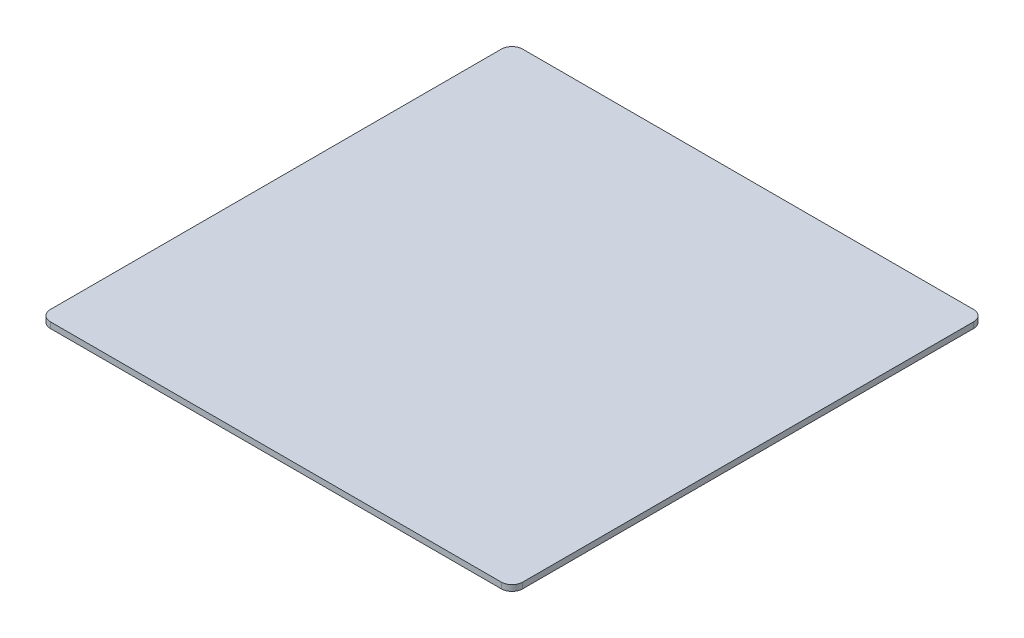
ISO-10303-21;
HEADER;
FILE_DESCRIPTION(('STEP AP214'),'2;1');
FILE_NAME('part.step','',(''),(''),'','','');
FILE_SCHEMA(('AUTOMOTIVE_DESIGN { 1 0 10303 214 1 1 1 1 }'));
ENDSEC;
DATA;
#1=APPLICATION_CONTEXT('core data for automotive mechanical design processes');
#2=APPLICATION_PROTOCOL_DEFINITION('international standard','automotive_design',2000,#1);
#3=PRODUCT_CONTEXT('',#1,'mechanical');
#4=PRODUCT('Part','Part','',(#3));
#5=PRODUCT_RELATED_PRODUCT_CATEGORY('part','',(#4));
#6=PRODUCT_DEFINITION_FORMATION('','',#4);
#7=PRODUCT_DEFINITION_CONTEXT('part definition',#1,'design');
#8=PRODUCT_DEFINITION('design','',#6,#7);
#9=PRODUCT_DEFINITION_SHAPE('','',#8);
#10=(LENGTH_UNIT() NAMED_UNIT(*) SI_UNIT(.MILLI.,.METRE.));
#11=(NAMED_UNIT(*) PLANE_ANGLE_UNIT() SI_UNIT($,.RADIAN.));
#12=(NAMED_UNIT(*) SI_UNIT($,.STERADIAN.) SOLID_ANGLE_UNIT());
#13=UNCERTAINTY_MEASURE_WITH_UNIT(LENGTH_MEASURE(1.E-05),#10,'distance_accuracy_value','');
#14=(GEOMETRIC_REPRESENTATION_CONTEXT(3) GLOBAL_UNCERTAINTY_ASSIGNED_CONTEXT((#13)) GLOBAL_UNIT_ASSIGNED_CONTEXT((#10,
#11,#12)) REPRESENTATION_CONTEXT('',''));
#15=CARTESIAN_POINT('',(0.,0.,0.));
#16=DIRECTION('',(0.,0.,1.));
#17=DIRECTION('',(1.,0.,0.));
#18=AXIS2_PLACEMENT_3D('',#15,#16,#17);
#19=CARTESIAN_POINT('',(148.,3.85,148.));
#20=DIRECTION('',(0.,-1.,0.));
#21=DIRECTION('',(0.,0.,-1.));
#22=AXIS2_PLACEMENT_3D('',#19,#20,#21);
#23=CYLINDRICAL_SURFACE('',#22,7.);
#24=CARTESIAN_POINT('',(148.,3.85,148.));
#25=DIRECTION('',(0.,1.,0.));
#26=DIRECTION('',(0.,0.,-1.));
#27=AXIS2_PLACEMENT_3D('',#24,#25,#26);
#28=CIRCLE('',#27,7.);
#29=CARTESIAN_POINT('',(148.,3.85,155.));
#30=VERTEX_POINT('',#29);
#31=CARTESIAN_POINT('',(155.,3.85,148.));
#32=VERTEX_POINT('',#31);
#33=EDGE_CURVE('E96',#30,#32,#28,.T.);
#34=ORIENTED_EDGE('',*,*,#33,.F.);
#35=DIRECTION('',(0.,1.,0.));
#36=VECTOR('',#35,1.);
#37=CARTESIAN_POINT('',(148.,3.85,155.));
#38=LINE('',#37,#36);
#39=CARTESIAN_POINT('',(148.,0.,155.));
#40=VERTEX_POINT('',#39);
#41=EDGE_CURVE('E131',#40,#30,#38,.T.);
#42=ORIENTED_EDGE('',*,*,#41,.F.);
#43=CARTESIAN_POINT('',(148.,0.,148.));
#44=DIRECTION('',(0.,-1.,0.));
#45=DIRECTION('',(0.,0.,-1.));
#46=AXIS2_PLACEMENT_3D('',#43,#44,#45);
#47=CIRCLE('',#46,7.);
#48=CARTESIAN_POINT('',(155.,0.,148.));
#49=VERTEX_POINT('',#48);
#50=EDGE_CURVE('E26',#49,#40,#47,.T.);
#51=ORIENTED_EDGE('',*,*,#50,.F.);
#52=DIRECTION('',(0.,-1.,0.));
#53=VECTOR('',#52,1.);
#54=CARTESIAN_POINT('',(155.,3.85,148.));
#55=LINE('',#54,#53);
#56=EDGE_CURVE('E111',#32,#49,#55,.T.);
#57=ORIENTED_EDGE('',*,*,#56,.F.);
#58=EDGE_LOOP('',(#34,#42,#51,#57));
#59=FACE_BOUND('',#58,.T.);
#60=ADVANCED_FACE('F17',(#59),#23,.T.);
#61=CARTESIAN_POINT('',(148.,3.85,-148.));
#62=DIRECTION('',(0.,-1.,0.));
#63=DIRECTION('',(0.,0.,-1.));
#64=AXIS2_PLACEMENT_3D('',#61,#62,#63);
#65=CYLINDRICAL_SURFACE('',#64,7.);
#66=CARTESIAN_POINT('',(148.,3.85,-148.));
#67=DIRECTION('',(0.,1.,0.));
#68=DIRECTION('',(0.,0.,-1.));
#69=AXIS2_PLACEMENT_3D('',#66,#67,#68);
#70=CIRCLE('',#69,7.);
#71=CARTESIAN_POINT('',(155.,3.85,-148.));
#72=VERTEX_POINT('',#71);
#73=CARTESIAN_POINT('',(148.,3.85,-155.));
#74=VERTEX_POINT('',#73);
#75=EDGE_CURVE('E39',#72,#74,#70,.T.);
#76=ORIENTED_EDGE('',*,*,#75,.F.);
#77=DIRECTION('',(0.,1.,0.));
#78=VECTOR('',#77,1.);
#79=CARTESIAN_POINT('',(155.,3.85,-148.));
#80=LINE('',#79,#78);
#81=CARTESIAN_POINT('',(155.,0.,-148.));
#82=VERTEX_POINT('',#81);
#83=EDGE_CURVE('E120',#82,#72,#80,.T.);
#84=ORIENTED_EDGE('',*,*,#83,.F.);
#85=CARTESIAN_POINT('',(148.,0.,-148.));
#86=DIRECTION('',(0.,-1.,0.));
#87=DIRECTION('',(0.,0.,-1.));
#88=AXIS2_PLACEMENT_3D('',#85,#86,#87);
#89=CIRCLE('',#88,7.);
#90=CARTESIAN_POINT('',(148.,0.,-155.));
#91=VERTEX_POINT('',#90);
#92=EDGE_CURVE('E140',#91,#82,#89,.T.);
#93=ORIENTED_EDGE('',*,*,#92,.F.);
#94=DIRECTION('',(0.,-1.,0.));
#95=VECTOR('',#94,1.);
#96=CARTESIAN_POINT('',(148.,3.85,-155.));
#97=LINE('',#96,#95);
#98=EDGE_CURVE('E139',#74,#91,#97,.T.);
#99=ORIENTED_EDGE('',*,*,#98,.F.);
#100=EDGE_LOOP('',(#76,#84,#93,#99));
#101=FACE_BOUND('',#100,.T.);
#102=ADVANCED_FACE('F219',(#101),#65,.T.);
#103=CARTESIAN_POINT('',(-148.,3.85,148.));
#104=DIRECTION('',(0.,-1.,0.));
#105=DIRECTION('',(0.,0.,-1.));
#106=AXIS2_PLACEMENT_3D('',#103,#104,#105);
#107=CYLINDRICAL_SURFACE('',#106,7.);
#108=CARTESIAN_POINT('',(-148.,3.85,148.));
#109=DIRECTION('',(0.,1.,0.));
#110=DIRECTION('',(0.,0.,-1.));
#111=AXIS2_PLACEMENT_3D('',#108,#109,#110);
#112=CIRCLE('',#111,7.);
#113=CARTESIAN_POINT('',(-155.,3.85,148.));
#114=VERTEX_POINT('',#113);
#115=CARTESIAN_POINT('',(-148.,3.85,155.));
#116=VERTEX_POINT('',#115);
#117=EDGE_CURVE('E108',#114,#116,#112,.T.);
#118=ORIENTED_EDGE('',*,*,#117,.F.);
#119=DIRECTION('',(0.,1.,0.));
#120=VECTOR('',#119,1.);
#121=CARTESIAN_POINT('',(-155.,3.85,148.));
#122=LINE('',#121,#120);
#123=CARTESIAN_POINT('',(-155.,0.,148.));
#124=VERTEX_POINT('',#123);
#125=EDGE_CURVE('E173',#124,#114,#122,.T.);
#126=ORIENTED_EDGE('',*,*,#125,.F.);
#127=CARTESIAN_POINT('',(-148.,0.,148.));
#128=DIRECTION('',(0.,-1.,0.));
#129=DIRECTION('',(0.,0.,-1.));
#130=AXIS2_PLACEMENT_3D('',#127,#128,#129);
#131=CIRCLE('',#130,7.);
#132=CARTESIAN_POINT('',(-148.,0.,155.));
#133=VERTEX_POINT('',#132);
#134=EDGE_CURVE('E11',#133,#124,#131,.T.);
#135=ORIENTED_EDGE('',*,*,#134,.F.);
#136=DIRECTION('',(0.,-1.,0.));
#137=VECTOR('',#136,1.);
#138=CARTESIAN_POINT('',(-148.,3.85,155.));
#139=LINE('',#138,#137);
#140=EDGE_CURVE('E165',#116,#133,#139,.T.);
#141=ORIENTED_EDGE('',*,*,#140,.F.);
#142=EDGE_LOOP('',(#118,#126,#135,#141));
#143=FACE_BOUND('',#142,.T.);
#144=ADVANCED_FACE('F225',(#143),#107,.T.);
#145=CARTESIAN_POINT('',(-148.,3.85,-148.));
#146=DIRECTION('',(0.,-1.,0.));
#147=DIRECTION('',(0.,0.,-1.));
#148=AXIS2_PLACEMENT_3D('',#145,#146,#147);
#149=CYLINDRICAL_SURFACE('',#148,7.);
#150=CARTESIAN_POINT('',(-148.,3.85,-148.));
#151=DIRECTION('',(0.,1.,0.));
#152=DIRECTION('',(0.,0.,-1.));
#153=AXIS2_PLACEMENT_3D('',#150,#151,#152);
#154=CIRCLE('',#153,7.);
#155=CARTESIAN_POINT('',(-148.,3.85,-155.));
#156=VERTEX_POINT('',#155);
#157=CARTESIAN_POINT('',(-155.,3.85,-148.));
#158=VERTEX_POINT('',#157);
#159=EDGE_CURVE('E144',#156,#158,#154,.T.);
#160=ORIENTED_EDGE('',*,*,#159,.F.);
#161=DIRECTION('',(0.,1.,0.));
#162=VECTOR('',#161,1.);
#163=CARTESIAN_POINT('',(-148.,3.85,-155.));
#164=LINE('',#163,#162);
#165=CARTESIAN_POINT('',(-148.,0.,-155.));
#166=VERTEX_POINT('',#165);
#167=EDGE_CURVE('E135',#166,#156,#164,.T.);
#168=ORIENTED_EDGE('',*,*,#167,.F.);
#169=CARTESIAN_POINT('',(-148.,0.,-148.));
#170=DIRECTION('',(0.,-1.,0.));
#171=DIRECTION('',(0.,0.,-1.));
#172=AXIS2_PLACEMENT_3D('',#169,#170,#171);
#173=CIRCLE('',#172,7.);
#174=CARTESIAN_POINT('',(-155.,0.,-148.));
#175=VERTEX_POINT('',#174);
#176=EDGE_CURVE('E143',#175,#166,#173,.T.);
#177=ORIENTED_EDGE('',*,*,#176,.F.);
#178=DIRECTION('',(0.,-1.,0.));
#179=VECTOR('',#178,1.);
#180=CARTESIAN_POINT('',(-155.,3.85,-148.));
#181=LINE('',#180,#179);
#182=EDGE_CURVE('E181',#158,#175,#181,.T.);
#183=ORIENTED_EDGE('',*,*,#182,.F.);
#184=EDGE_LOOP('',(#160,#168,#177,#183));
#185=FACE_BOUND('',#184,.T.);
#186=ADVANCED_FACE('F230',(#185),#149,.T.);
#187=CARTESIAN_POINT('',(0.,0.,0.));
#188=DIRECTION('',(0.,-1.,0.));
#189=DIRECTION('',(0.,0.,-1.));
#190=AXIS2_PLACEMENT_3D('',#187,#188,#189);
#191=PLANE('',#190);
#192=DIRECTION('',(0.,0.,1.));
#193=VECTOR('',#192,1.);
#194=CARTESIAN_POINT('',(-155.,0.,-155.));
#195=LINE('',#194,#193);
#196=EDGE_CURVE('E177',#175,#124,#195,.T.);
#197=ORIENTED_EDGE('',*,*,#196,.F.);
#198=ORIENTED_EDGE('',*,*,#176,.T.);
#199=DIRECTION('',(-1.,0.,0.));
#200=VECTOR('',#199,1.);
#201=CARTESIAN_POINT('',(155.,0.,-155.));
#202=LINE('',#201,#200);
#203=EDGE_CURVE('E116',#91,#166,#202,.T.);
#204=ORIENTED_EDGE('',*,*,#203,.F.);
#205=ORIENTED_EDGE('',*,*,#92,.T.);
#206=DIRECTION('',(0.,0.,-1.));
#207=VECTOR('',#206,1.);
#208=CARTESIAN_POINT('',(155.,0.,-155.));
#209=LINE('',#208,#207);
#210=EDGE_CURVE('E127',#49,#82,#209,.T.);
#211=ORIENTED_EDGE('',*,*,#210,.F.);
#212=ORIENTED_EDGE('',*,*,#50,.T.);
#213=DIRECTION('',(1.,0.,0.));
#214=VECTOR('',#213,1.);
#215=CARTESIAN_POINT('',(155.,0.,155.));
#216=LINE('',#215,#214);
#217=EDGE_CURVE('E159',#133,#40,#216,.T.);
#218=ORIENTED_EDGE('',*,*,#217,.F.);
#219=ORIENTED_EDGE('',*,*,#134,.T.);
#220=EDGE_LOOP('',(#197,#198,#204,#205,#211,#212,#218,#219));
#221=FACE_BOUND('',#220,.T.);
#222=ADVANCED_FACE('F157',(#221),#191,.T.);
#223=CARTESIAN_POINT('',(0.,3.85,0.));
#224=DIRECTION('',(0.,-1.,0.));
#225=DIRECTION('',(0.,0.,-1.));
#226=AXIS2_PLACEMENT_3D('',#223,#224,#225);
#227=PLANE('',#226);
#228=DIRECTION('',(-1.,0.,0.));
#229=VECTOR('',#228,1.);
#230=CARTESIAN_POINT('',(155.,3.85,-155.));
#231=LINE('',#230,#229);
#232=EDGE_CURVE('E136',#74,#156,#231,.T.);
#233=ORIENTED_EDGE('',*,*,#232,.T.);
#234=ORIENTED_EDGE('',*,*,#159,.T.);
#235=DIRECTION('',(0.,0.,1.));
#236=VECTOR('',#235,1.);
#237=CARTESIAN_POINT('',(-155.,3.85,-155.));
#238=LINE('',#237,#236);
#239=EDGE_CURVE('E188',#158,#114,#238,.T.);
#240=ORIENTED_EDGE('',*,*,#239,.T.);
#241=ORIENTED_EDGE('',*,*,#117,.T.);
#242=DIRECTION('',(1.,0.,0.));
#243=VECTOR('',#242,1.);
#244=CARTESIAN_POINT('',(155.,3.85,155.));
#245=LINE('',#244,#243);
#246=EDGE_CURVE('E103',#116,#30,#245,.T.);
#247=ORIENTED_EDGE('',*,*,#246,.T.);
#248=ORIENTED_EDGE('',*,*,#33,.T.);
#249=DIRECTION('',(0.,0.,-1.));
#250=VECTOR('',#249,1.);
#251=CARTESIAN_POINT('',(155.,3.85,-155.));
#252=LINE('',#251,#250);
#253=EDGE_CURVE('E100',#32,#72,#252,.T.);
#254=ORIENTED_EDGE('',*,*,#253,.T.);
#255=ORIENTED_EDGE('',*,*,#75,.T.);
#256=EDGE_LOOP('',(#233,#234,#240,#241,#247,#248,#254,#255));
#257=FACE_BOUND('',#256,.T.);
#258=ADVANCED_FACE('F98',(#257),#227,.F.);
#259=CARTESIAN_POINT('',(155.,3.85,-155.));
#260=DIRECTION('',(0.,0.,1.));
#261=DIRECTION('',(1.,0.,0.));
#262=AXIS2_PLACEMENT_3D('',#259,#260,#261);
#263=PLANE('',#262);
#264=ORIENTED_EDGE('',*,*,#203,.T.);
#265=ORIENTED_EDGE('',*,*,#167,.T.);
#266=ORIENTED_EDGE('',*,*,#232,.F.);
#267=ORIENTED_EDGE('',*,*,#98,.T.);
#268=EDGE_LOOP('',(#264,#265,#266,#267));
#269=FACE_BOUND('',#268,.T.);
#270=ADVANCED_FACE('F241',(#269),#263,.F.);
#271=CARTESIAN_POINT('',(155.,3.85,-155.));
#272=DIRECTION('',(-1.,0.,0.));
#273=DIRECTION('',(0.,1.,0.));
#274=AXIS2_PLACEMENT_3D('',#271,#272,#273);
#275=PLANE('',#274);
#276=ORIENTED_EDGE('',*,*,#210,.T.);
#277=ORIENTED_EDGE('',*,*,#83,.T.);
#278=ORIENTED_EDGE('',*,*,#253,.F.);
#279=ORIENTED_EDGE('',*,*,#56,.T.);
#280=EDGE_LOOP('',(#276,#277,#278,#279));
#281=FACE_BOUND('',#280,.T.);
#282=ADVANCED_FACE('F118',(#281),#275,.F.);
#283=CARTESIAN_POINT('',(155.,3.85,155.));
#284=DIRECTION('',(0.,0.,-1.));
#285=DIRECTION('',(-1.,0.,0.));
#286=AXIS2_PLACEMENT_3D('',#283,#284,#285);
#287=PLANE('',#286);
#288=ORIENTED_EDGE('',*,*,#246,.F.);
#289=ORIENTED_EDGE('',*,*,#140,.T.);
#290=ORIENTED_EDGE('',*,*,#217,.T.);
#291=ORIENTED_EDGE('',*,*,#41,.T.);
#292=EDGE_LOOP('',(#288,#289,#290,#291));
#293=FACE_BOUND('',#292,.T.);
#294=ADVANCED_FACE('F163',(#293),#287,.F.);
#295=CARTESIAN_POINT('',(-155.,3.85,-155.));
#296=DIRECTION('',(1.,0.,0.));
#297=DIRECTION('',(0.,0.,-1.));
#298=AXIS2_PLACEMENT_3D('',#295,#296,#297);
#299=PLANE('',#298);
#300=ORIENTED_EDGE('',*,*,#239,.F.);
#301=ORIENTED_EDGE('',*,*,#182,.T.);
#302=ORIENTED_EDGE('',*,*,#196,.T.);
#303=ORIENTED_EDGE('',*,*,#125,.T.);
#304=EDGE_LOOP('',(#300,#301,#302,#303));
#305=FACE_BOUND('',#304,.T.);
#306=ADVANCED_FACE('F205',(#305),#299,.F.);
#307=CLOSED_SHELL('',(#60,#102,#144,#186,#222,#258,#270,#282,#294,#306));
#308=MANIFOLD_SOLID_BREP('B1',#307);
#309=ADVANCED_BREP_SHAPE_REPRESENTATION('',(#18,#308),#14);
#310=SHAPE_DEFINITION_REPRESENTATION(#9,#309);
ENDSEC;
END-ISO-10303-21;
